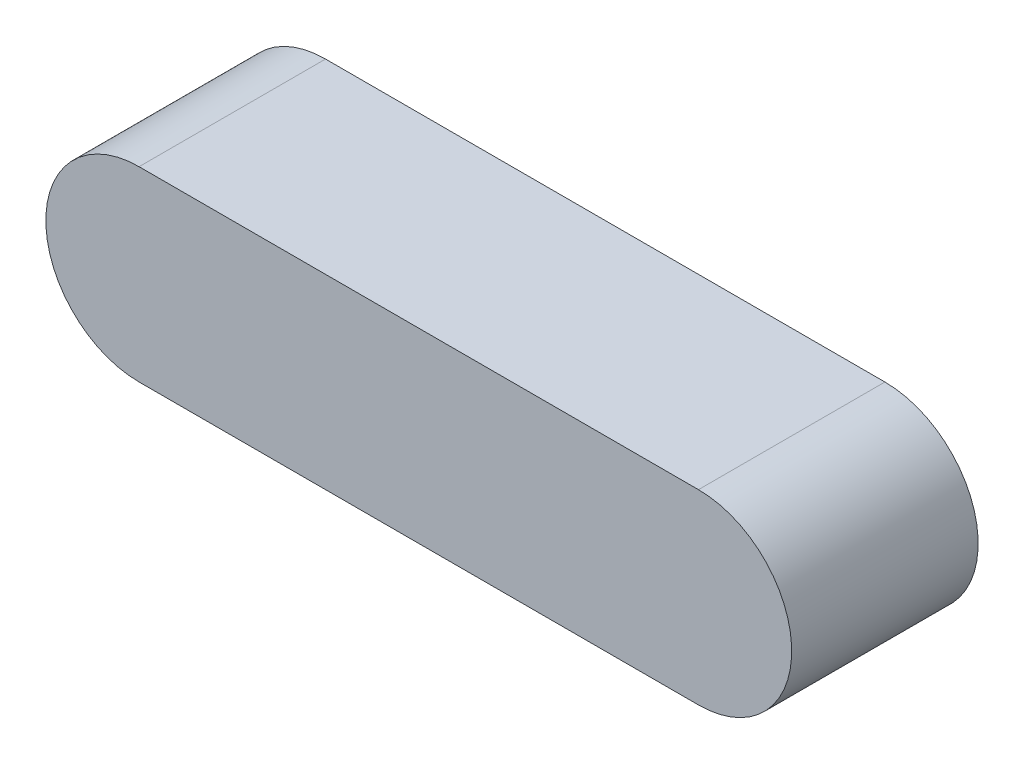
ISO-10303-21;
HEADER;
FILE_DESCRIPTION(('STEP AP214'),'2;1');
FILE_NAME('part.step','',(''),(''),'','','');
FILE_SCHEMA(('AUTOMOTIVE_DESIGN { 1 0 10303 214 1 1 1 1 }'));
ENDSEC;
DATA;
#1=APPLICATION_CONTEXT('core data for automotive mechanical design processes');
#2=APPLICATION_PROTOCOL_DEFINITION('international standard','automotive_design',2000,#1);
#3=PRODUCT_CONTEXT('',#1,'mechanical');
#4=PRODUCT('Part','Part','',(#3));
#5=PRODUCT_RELATED_PRODUCT_CATEGORY('part','',(#4));
#6=PRODUCT_DEFINITION_FORMATION('','',#4);
#7=PRODUCT_DEFINITION_CONTEXT('part definition',#1,'design');
#8=PRODUCT_DEFINITION('design','',#6,#7);
#9=PRODUCT_DEFINITION_SHAPE('','',#8);
#10=(LENGTH_UNIT() NAMED_UNIT(*) SI_UNIT(.MILLI.,.METRE.));
#11=(NAMED_UNIT(*) PLANE_ANGLE_UNIT() SI_UNIT($,.RADIAN.));
#12=(NAMED_UNIT(*) SI_UNIT($,.STERADIAN.) SOLID_ANGLE_UNIT());
#13=UNCERTAINTY_MEASURE_WITH_UNIT(LENGTH_MEASURE(1.E-05),#10,'distance_accuracy_value','');
#14=(GEOMETRIC_REPRESENTATION_CONTEXT(3) GLOBAL_UNCERTAINTY_ASSIGNED_CONTEXT((#13)) GLOBAL_UNIT_ASSIGNED_CONTEXT((#10,
#11,#12)) REPRESENTATION_CONTEXT('',''));
#15=CARTESIAN_POINT('',(0.,0.,0.));
#16=DIRECTION('',(0.,0.,1.));
#17=DIRECTION('',(1.,0.,0.));
#18=AXIS2_PLACEMENT_3D('',#15,#16,#17);
#19=CARTESIAN_POINT('',(-6.35,-3.175,1.5875));
#20=DIRECTION('',(0.,1.,0.));
#21=DIRECTION('',(0.,0.,1.));
#22=AXIS2_PLACEMENT_3D('',#19,#20,#21);
#23=PLANE('',#22);
#24=DIRECTION('',(0.,0.,1.));
#25=VECTOR('',#24,1.);
#26=CARTESIAN_POINT('',(4.76250000000003,-3.17500000000001,-1.5875));
#27=LINE('',#26,#25);
#28=CARTESIAN_POINT('',(4.76250000000003,-3.17500000000001,-1.5875));
#29=VERTEX_POINT('',#28);
#30=CARTESIAN_POINT('',(4.76250000000003,-3.17500000000001,1.5875));
#31=VERTEX_POINT('',#30);
#32=EDGE_CURVE('E76',#29,#31,#27,.T.);
#33=ORIENTED_EDGE('',*,*,#32,.T.);
#34=DIRECTION('',(1.,0.,0.));
#35=VECTOR('',#34,1.);
#36=CARTESIAN_POINT('',(-6.35,-3.175,1.5875));
#37=LINE('',#36,#35);
#38=CARTESIAN_POINT('',(-4.7625,-3.17500000000001,1.5875));
#39=VERTEX_POINT('',#38);
#40=EDGE_CURVE('E43',#39,#31,#37,.T.);
#41=ORIENTED_EDGE('',*,*,#40,.F.);
#42=DIRECTION('',(0.,0.,1.));
#43=VECTOR('',#42,1.);
#44=CARTESIAN_POINT('',(-4.7625,-3.17500000000001,-1.5875));
#45=LINE('',#44,#43);
#46=CARTESIAN_POINT('',(-4.7625,-3.17500000000001,-1.5875));
#47=VERTEX_POINT('',#46);
#48=EDGE_CURVE('E84',#47,#39,#45,.T.);
#49=ORIENTED_EDGE('',*,*,#48,.F.);
#50=DIRECTION('',(-1.,0.,0.));
#51=VECTOR('',#50,1.);
#52=CARTESIAN_POINT('',(-6.35,-3.175,-1.5875));
#53=LINE('',#52,#51);
#54=EDGE_CURVE('E12',#29,#47,#53,.T.);
#55=ORIENTED_EDGE('',*,*,#54,.F.);
#56=EDGE_LOOP('',(#33,#41,#49,#55));
#57=FACE_BOUND('',#56,.T.);
#58=ADVANCED_FACE('F34',(#57),#23,.F.);
#59=CARTESIAN_POINT('',(-6.35,0.,1.5875));
#60=DIRECTION('',(0.,1.,0.));
#61=DIRECTION('',(0.,0.,1.));
#62=AXIS2_PLACEMENT_3D('',#59,#60,#61);
#63=PLANE('',#62);
#64=DIRECTION('',(1.,0.,0.));
#65=VECTOR('',#64,1.);
#66=CARTESIAN_POINT('',(-6.35,0.,1.5875));
#67=LINE('',#66,#65);
#68=CARTESIAN_POINT('',(-4.7625,0.,1.5875));
#69=VERTEX_POINT('',#68);
#70=CARTESIAN_POINT('',(4.76250000000003,0.,1.5875));
#71=VERTEX_POINT('',#70);
#72=EDGE_CURVE('E83',#69,#71,#67,.T.);
#73=ORIENTED_EDGE('',*,*,#72,.T.);
#74=DIRECTION('',(0.,0.,1.));
#75=VECTOR('',#74,1.);
#76=CARTESIAN_POINT('',(4.76250000000003,0.,-1.5875));
#77=LINE('',#76,#75);
#78=CARTESIAN_POINT('',(4.76250000000003,0.,-1.5875));
#79=VERTEX_POINT('',#78);
#80=EDGE_CURVE('E96',#79,#71,#77,.T.);
#81=ORIENTED_EDGE('',*,*,#80,.F.);
#82=DIRECTION('',(-1.,0.,0.));
#83=VECTOR('',#82,1.);
#84=CARTESIAN_POINT('',(-6.35,0.,-1.5875));
#85=LINE('',#84,#83);
#86=CARTESIAN_POINT('',(-4.7625,0.,-1.5875));
#87=VERTEX_POINT('',#86);
#88=EDGE_CURVE('E38',#79,#87,#85,.T.);
#89=ORIENTED_EDGE('',*,*,#88,.T.);
#90=DIRECTION('',(0.,0.,1.));
#91=VECTOR('',#90,1.);
#92=CARTESIAN_POINT('',(-4.7625,0.,-1.5875));
#93=LINE('',#92,#91);
#94=EDGE_CURVE('E94',#87,#69,#93,.T.);
#95=ORIENTED_EDGE('',*,*,#94,.T.);
#96=EDGE_LOOP('',(#73,#81,#89,#95));
#97=FACE_BOUND('',#96,.T.);
#98=ADVANCED_FACE('F103',(#97),#63,.T.);
#99=CARTESIAN_POINT('',(-6.35,-3.175,-1.5875));
#100=DIRECTION('',(0.,0.,-1.));
#101=DIRECTION('',(-1.,0.,0.));
#102=AXIS2_PLACEMENT_3D('',#99,#100,#101);
#103=PLANE('',#102);
#104=CARTESIAN_POINT('',(4.76250000000003,-1.5875,-1.5875));
#105=DIRECTION('',(0.,0.,-1.));
#106=DIRECTION('',(-1.,0.,0.));
#107=AXIS2_PLACEMENT_3D('',#104,#105,#106);
#108=CIRCLE('',#107,1.5875);
#109=EDGE_CURVE('E51',#79,#29,#108,.T.);
#110=ORIENTED_EDGE('',*,*,#109,.T.);
#111=ORIENTED_EDGE('',*,*,#54,.T.);
#112=CARTESIAN_POINT('',(-4.7625,-1.5875,-1.5875));
#113=DIRECTION('',(0.,0.,-1.));
#114=DIRECTION('',(-1.,0.,0.));
#115=AXIS2_PLACEMENT_3D('',#112,#113,#114);
#116=CIRCLE('',#115,1.5875);
#117=EDGE_CURVE('E91',#47,#87,#116,.T.);
#118=ORIENTED_EDGE('',*,*,#117,.T.);
#119=ORIENTED_EDGE('',*,*,#88,.F.);
#120=EDGE_LOOP('',(#110,#111,#118,#119));
#121=FACE_BOUND('',#120,.T.);
#122=ADVANCED_FACE('F88',(#121),#103,.T.);
#123=CARTESIAN_POINT('',(-6.35,-3.175,1.5875));
#124=DIRECTION('',(0.,0.,1.));
#125=DIRECTION('',(1.,0.,0.));
#126=AXIS2_PLACEMENT_3D('',#123,#124,#125);
#127=PLANE('',#126);
#128=CARTESIAN_POINT('',(4.76250000000003,-1.5875,1.5875));
#129=DIRECTION('',(0.,0.,-1.));
#130=DIRECTION('',(-1.,0.,0.));
#131=AXIS2_PLACEMENT_3D('',#128,#129,#130);
#132=CIRCLE('',#131,1.5875);
#133=EDGE_CURVE('E78',#71,#31,#132,.T.);
#134=ORIENTED_EDGE('',*,*,#133,.F.);
#135=ORIENTED_EDGE('',*,*,#72,.F.);
#136=CARTESIAN_POINT('',(-4.7625,-1.5875,1.5875));
#137=DIRECTION('',(0.,0.,-1.));
#138=DIRECTION('',(-1.,0.,0.));
#139=AXIS2_PLACEMENT_3D('',#136,#137,#138);
#140=CIRCLE('',#139,1.5875);
#141=EDGE_CURVE('E59',#39,#69,#140,.T.);
#142=ORIENTED_EDGE('',*,*,#141,.F.);
#143=ORIENTED_EDGE('',*,*,#40,.T.);
#144=EDGE_LOOP('',(#134,#135,#142,#143));
#145=FACE_BOUND('',#144,.T.);
#146=ADVANCED_FACE('F36',(#145),#127,.T.);
#147=CARTESIAN_POINT('',(-4.7625,-1.5875,-1.5875));
#148=DIRECTION('',(0.,0.,1.));
#149=DIRECTION('',(1.,0.,0.));
#150=AXIS2_PLACEMENT_3D('',#147,#148,#149);
#151=CYLINDRICAL_SURFACE('',#150,1.5875);
#152=ORIENTED_EDGE('',*,*,#141,.T.);
#153=ORIENTED_EDGE('',*,*,#94,.F.);
#154=ORIENTED_EDGE('',*,*,#117,.F.);
#155=ORIENTED_EDGE('',*,*,#48,.T.);
#156=EDGE_LOOP('',(#152,#153,#154,#155));
#157=FACE_BOUND('',#156,.T.);
#158=ADVANCED_FACE('F107',(#157),#151,.T.);
#159=CARTESIAN_POINT('',(4.76250000000003,-1.5875,-1.5875));
#160=DIRECTION('',(0.,0.,1.));
#161=DIRECTION('',(1.,0.,0.));
#162=AXIS2_PLACEMENT_3D('',#159,#160,#161);
#163=CYLINDRICAL_SURFACE('',#162,1.5875);
#164=ORIENTED_EDGE('',*,*,#133,.T.);
#165=ORIENTED_EDGE('',*,*,#32,.F.);
#166=ORIENTED_EDGE('',*,*,#109,.F.);
#167=ORIENTED_EDGE('',*,*,#80,.T.);
#168=EDGE_LOOP('',(#164,#165,#166,#167));
#169=FACE_BOUND('',#168,.T.);
#170=ADVANCED_FACE('F77',(#169),#163,.T.);
#171=CLOSED_SHELL('',(#58,#98,#122,#146,#158,#170));
#172=MANIFOLD_SOLID_BREP('B2',#171);
#173=ADVANCED_BREP_SHAPE_REPRESENTATION('',(#18,#172),#14);
#174=SHAPE_DEFINITION_REPRESENTATION(#9,#173);
ENDSEC;
END-ISO-10303-21;
